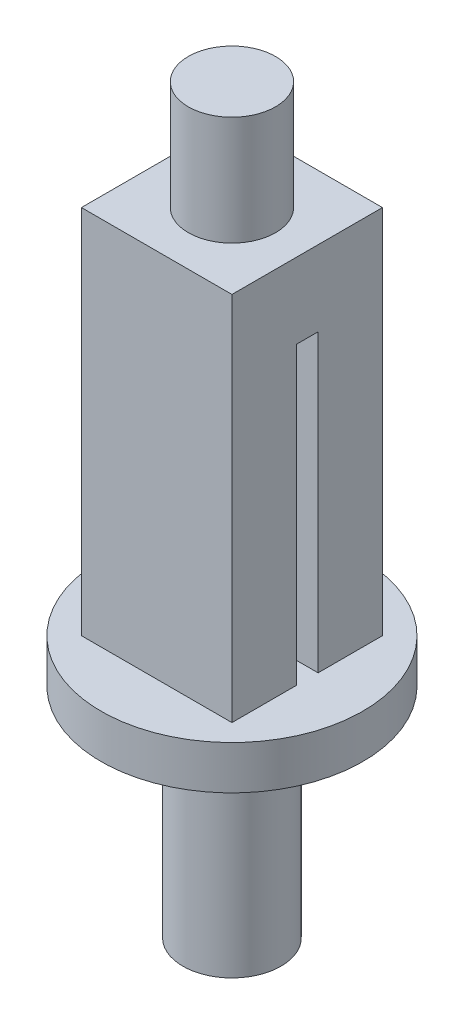
ISO-10303-21;
HEADER;
FILE_DESCRIPTION(('STEP AP214'),'2;1');
FILE_NAME('part.step','',(''),(''),'','','');
FILE_SCHEMA(('AUTOMOTIVE_DESIGN { 1 0 10303 214 1 1 1 1 }'));
ENDSEC;
DATA;
#1=APPLICATION_CONTEXT('core data for automotive mechanical design processes');
#2=APPLICATION_PROTOCOL_DEFINITION('international standard','automotive_design',2000,#1);
#3=PRODUCT_CONTEXT('',#1,'mechanical');
#4=PRODUCT('Part','Part','',(#3));
#5=PRODUCT_RELATED_PRODUCT_CATEGORY('part','',(#4));
#6=PRODUCT_DEFINITION_FORMATION('','',#4);
#7=PRODUCT_DEFINITION_CONTEXT('part definition',#1,'design');
#8=PRODUCT_DEFINITION('design','',#6,#7);
#9=PRODUCT_DEFINITION_SHAPE('','',#8);
#10=(LENGTH_UNIT() NAMED_UNIT(*) SI_UNIT(.MILLI.,.METRE.));
#11=(NAMED_UNIT(*) PLANE_ANGLE_UNIT() SI_UNIT($,.RADIAN.));
#12=(NAMED_UNIT(*) SI_UNIT($,.STERADIAN.) SOLID_ANGLE_UNIT());
#13=UNCERTAINTY_MEASURE_WITH_UNIT(LENGTH_MEASURE(1.E-05),#10,'distance_accuracy_value','');
#14=(GEOMETRIC_REPRESENTATION_CONTEXT(3) GLOBAL_UNCERTAINTY_ASSIGNED_CONTEXT((#13)) GLOBAL_UNIT_ASSIGNED_CONTEXT((#10,
#11,#12)) REPRESENTATION_CONTEXT('',''));
#15=CARTESIAN_POINT('',(0.,0.,0.));
#16=DIRECTION('',(0.,0.,1.));
#17=DIRECTION('',(1.,0.,0.));
#18=AXIS2_PLACEMENT_3D('',#15,#16,#17);
#19=CARTESIAN_POINT('',(11.4316176470588,0.,-1.12573529411769));
#20=DIRECTION('',(0.,0.,-1.));
#21=DIRECTION('',(-1.,0.,0.));
#22=AXIS2_PLACEMENT_3D('',#19,#20,#21);
#23=PLANE('',#22);
#24=DIRECTION('',(-1.,0.,0.));
#25=VECTOR('',#24,1.);
#26=CARTESIAN_POINT('',(11.4316176470588,13.5425407491431,-1.12573529411769));
#27=LINE('',#26,#25);
#28=CARTESIAN_POINT('',(3.33161764705882,13.5425407491431,-1.12573529411769));
#29=VERTEX_POINT('',#28);
#30=CARTESIAN_POINT('',(1.29583120943192,13.5425407491431,-1.12573529411768));
#31=VERTEX_POINT('',#30);
#32=EDGE_CURVE('E175',#29,#31,#27,.T.);
#33=ORIENTED_EDGE('',*,*,#32,.T.);
#34=DIRECTION('',(0.,-1.,0.));
#35=VECTOR('',#34,1.);
#36=CARTESIAN_POINT('',(1.29583120943192,17.7851814362623,-1.12573529411769));
#37=LINE('',#36,#35);
#38=CARTESIAN_POINT('',(1.29583120943192,0.,-1.12573529411769));
#39=VERTEX_POINT('',#38);
#40=EDGE_CURVE('E270',#31,#39,#37,.T.);
#41=ORIENTED_EDGE('',*,*,#40,.T.);
#42=DIRECTION('',(-1.,0.,0.));
#43=VECTOR('',#42,1.);
#44=CARTESIAN_POINT('',(0.,0.,-1.12573529411768));
#45=LINE('',#44,#43);
#46=CARTESIAN_POINT('',(3.33161764705882,0.,-1.12573529411769));
#47=VERTEX_POINT('',#46);
#48=EDGE_CURVE('E234',#47,#39,#45,.T.);
#49=ORIENTED_EDGE('',*,*,#48,.F.);
#50=DIRECTION('',(0.,-1.,0.));
#51=VECTOR('',#50,1.);
#52=CARTESIAN_POINT('',(3.33161764705882,17.,-1.12573529411769));
#53=LINE('',#52,#51);
#54=EDGE_CURVE('E180',#29,#47,#53,.T.);
#55=ORIENTED_EDGE('',*,*,#54,.F.);
#56=EDGE_LOOP('',(#33,#41,#49,#55));
#57=FACE_BOUND('',#56,.T.);
#58=ADVANCED_FACE('F39',(#57),#23,.F.);
#59=CARTESIAN_POINT('',(11.4316176470588,0.,-0.125735294117686));
#60=DIRECTION('',(0.,0.,1.));
#61=DIRECTION('',(1.,0.,0.));
#62=AXIS2_PLACEMENT_3D('',#59,#60,#61);
#63=PLANE('',#62);
#64=DIRECTION('',(-1.,0.,0.));
#65=VECTOR('',#64,1.);
#66=CARTESIAN_POINT('',(11.4316176470588,13.5425407491431,-0.125735294117686));
#67=LINE('',#66,#65);
#68=CARTESIAN_POINT('',(-1.53259591531427,13.5425407491431,-0.125735294117684));
#69=VERTEX_POINT('',#68);
#70=CARTESIAN_POINT('',(-3.56838235294118,13.5425407491431,-0.125735294117684));
#71=VERTEX_POINT('',#70);
#72=EDGE_CURVE('E154',#69,#71,#67,.T.);
#73=ORIENTED_EDGE('',*,*,#72,.F.);
#74=DIRECTION('',(0.,-1.,0.));
#75=VECTOR('',#74,1.);
#76=CARTESIAN_POINT('',(-1.53259591531427,17.7851814362623,-0.125735294117685));
#77=LINE('',#76,#75);
#78=CARTESIAN_POINT('',(-1.53259591531427,0.,-0.125735294117685));
#79=VERTEX_POINT('',#78);
#80=EDGE_CURVE('E138',#69,#79,#77,.T.);
#81=ORIENTED_EDGE('',*,*,#80,.T.);
#82=DIRECTION('',(1.,0.,0.));
#83=VECTOR('',#82,1.);
#84=CARTESIAN_POINT('',(0.,0.,-0.125735294117685));
#85=LINE('',#84,#83);
#86=CARTESIAN_POINT('',(-3.56838235294118,0.,-0.125735294117684));
#87=VERTEX_POINT('',#86);
#88=EDGE_CURVE('E231',#87,#79,#85,.T.);
#89=ORIENTED_EDGE('',*,*,#88,.F.);
#90=DIRECTION('',(0.,1.,0.));
#91=VECTOR('',#90,1.);
#92=CARTESIAN_POINT('',(-3.56838235294118,0.,-0.125735294117684));
#93=LINE('',#92,#91);
#94=EDGE_CURVE('E164',#87,#71,#93,.T.);
#95=ORIENTED_EDGE('',*,*,#94,.T.);
#96=EDGE_LOOP('',(#73,#81,#89,#95));
#97=FACE_BOUND('',#96,.T.);
#98=ADVANCED_FACE('F162',(#97),#63,.F.);
#99=CARTESIAN_POINT('',(-3.56838235294118,17.,-4.07573529411765));
#100=DIRECTION('',(1.,0.,0.));
#101=DIRECTION('',(0.,0.,-1.));
#102=AXIS2_PLACEMENT_3D('',#99,#100,#101);
#103=PLANE('',#102);
#104=DIRECTION('',(0.,0.,1.));
#105=VECTOR('',#104,1.);
#106=CARTESIAN_POINT('',(-3.56838235294118,0.,-4.07573529411765));
#107=LINE('',#106,#105);
#108=CARTESIAN_POINT('',(-3.56838235294118,0.,-4.07573529411765));
#109=VERTEX_POINT('',#108);
#110=CARTESIAN_POINT('',(-3.56838235294118,0.,-1.12573529411768));
#111=VERTEX_POINT('',#110);
#112=EDGE_CURVE('E206',#109,#111,#107,.T.);
#113=ORIENTED_EDGE('',*,*,#112,.T.);
#114=DIRECTION('',(0.,-1.,0.));
#115=VECTOR('',#114,1.);
#116=CARTESIAN_POINT('',(-3.56838235294118,0.,-1.12573529411768));
#117=LINE('',#116,#115);
#118=CARTESIAN_POINT('',(-3.56838235294118,13.5425407491431,-1.12573529411768));
#119=VERTEX_POINT('',#118);
#120=EDGE_CURVE('E250',#119,#111,#117,.T.);
#121=ORIENTED_EDGE('',*,*,#120,.F.);
#122=DIRECTION('',(0.,0.,-1.));
#123=VECTOR('',#122,1.);
#124=CARTESIAN_POINT('',(-3.56838235294118,13.5425407491431,-1.12573529411768));
#125=LINE('',#124,#123);
#126=EDGE_CURVE('E167',#71,#119,#125,.T.);
#127=ORIENTED_EDGE('',*,*,#126,.F.);
#128=ORIENTED_EDGE('',*,*,#94,.F.);
#129=CARTESIAN_POINT('',(-3.56838235294118,0.,2.82426470588235));
#130=VERTEX_POINT('',#129);
#131=EDGE_CURVE('E188',#87,#130,#107,.T.);
#132=ORIENTED_EDGE('',*,*,#131,.T.);
#133=DIRECTION('',(0.,-1.,0.));
#134=VECTOR('',#133,1.);
#135=CARTESIAN_POINT('',(-3.56838235294118,17.,2.82426470588235));
#136=LINE('',#135,#134);
#137=CARTESIAN_POINT('',(-3.56838235294118,17.,2.82426470588235));
#138=VERTEX_POINT('',#137);
#139=EDGE_CURVE('E194',#138,#130,#136,.T.);
#140=ORIENTED_EDGE('',*,*,#139,.F.);
#141=DIRECTION('',(0.,0.,1.));
#142=VECTOR('',#141,1.);
#143=CARTESIAN_POINT('',(-3.56838235294118,17.,-4.07573529411765));
#144=LINE('',#143,#142);
#145=CARTESIAN_POINT('',(-3.56838235294118,17.,-4.07573529411765));
#146=VERTEX_POINT('',#145);
#147=EDGE_CURVE('E195',#146,#138,#144,.T.);
#148=ORIENTED_EDGE('',*,*,#147,.F.);
#149=DIRECTION('',(0.,-1.,0.));
#150=VECTOR('',#149,1.);
#151=CARTESIAN_POINT('',(-3.56838235294118,17.,-4.07573529411765));
#152=LINE('',#151,#150);
#153=EDGE_CURVE('E205',#146,#109,#152,.T.);
#154=ORIENTED_EDGE('',*,*,#153,.T.);
#155=EDGE_LOOP('',(#113,#121,#127,#128,#132,#140,#148,#154));
#156=FACE_BOUND('',#155,.T.);
#157=ADVANCED_FACE('F41',(#156),#103,.F.);
#158=CARTESIAN_POINT('',(-3.56838235294118,17.,2.82426470588235));
#159=DIRECTION('',(0.,0.,-1.));
#160=DIRECTION('',(-1.,0.,0.));
#161=AXIS2_PLACEMENT_3D('',#158,#159,#160);
#162=PLANE('',#161);
#163=DIRECTION('',(1.,0.,0.));
#164=VECTOR('',#163,1.);
#165=CARTESIAN_POINT('',(-3.56838235294118,0.,2.82426470588235));
#166=LINE('',#165,#164);
#167=CARTESIAN_POINT('',(3.33161764705882,0.,2.82426470588235));
#168=VERTEX_POINT('',#167);
#169=EDGE_CURVE('E210',#130,#168,#166,.T.);
#170=ORIENTED_EDGE('',*,*,#169,.T.);
#171=DIRECTION('',(0.,-1.,0.));
#172=VECTOR('',#171,1.);
#173=CARTESIAN_POINT('',(3.33161764705882,17.,2.82426470588235));
#174=LINE('',#173,#172);
#175=CARTESIAN_POINT('',(3.33161764705882,17.,2.82426470588235));
#176=VERTEX_POINT('',#175);
#177=EDGE_CURVE('E225',#176,#168,#174,.T.);
#178=ORIENTED_EDGE('',*,*,#177,.F.);
#179=DIRECTION('',(1.,0.,0.));
#180=VECTOR('',#179,1.);
#181=CARTESIAN_POINT('',(-3.56838235294118,17.,2.82426470588235));
#182=LINE('',#181,#180);
#183=EDGE_CURVE('E94',#138,#176,#182,.T.);
#184=ORIENTED_EDGE('',*,*,#183,.F.);
#185=ORIENTED_EDGE('',*,*,#139,.T.);
#186=EDGE_LOOP('',(#170,#178,#184,#185));
#187=FACE_BOUND('',#186,.T.);
#188=ADVANCED_FACE('F353',(#187),#162,.F.);
#189=CARTESIAN_POINT('',(3.33161764705882,17.,-4.07573529411765));
#190=DIRECTION('',(-1.,0.,0.));
#191=DIRECTION('',(0.,0.,1.));
#192=AXIS2_PLACEMENT_3D('',#189,#190,#191);
#193=PLANE('',#192);
#194=DIRECTION('',(0.,0.,-1.));
#195=VECTOR('',#194,1.);
#196=CARTESIAN_POINT('',(3.33161764705882,13.5425407491431,-4.07573529411765));
#197=LINE('',#196,#195);
#198=CARTESIAN_POINT('',(3.33161764705882,13.5425407491431,-0.125735294117685));
#199=VERTEX_POINT('',#198);
#200=EDGE_CURVE('E43',#199,#29,#197,.T.);
#201=ORIENTED_EDGE('',*,*,#200,.T.);
#202=ORIENTED_EDGE('',*,*,#54,.T.);
#203=DIRECTION('',(0.,0.,-1.));
#204=VECTOR('',#203,1.);
#205=CARTESIAN_POINT('',(3.33161764705882,0.,-4.07573529411765));
#206=LINE('',#205,#204);
#207=CARTESIAN_POINT('',(3.33161764705882,0.,-4.07573529411765));
#208=VERTEX_POINT('',#207);
#209=EDGE_CURVE('E213',#47,#208,#206,.T.);
#210=ORIENTED_EDGE('',*,*,#209,.T.);
#211=DIRECTION('',(0.,-1.,0.));
#212=VECTOR('',#211,1.);
#213=CARTESIAN_POINT('',(3.33161764705882,17.,-4.07573529411765));
#214=LINE('',#213,#212);
#215=CARTESIAN_POINT('',(3.33161764705882,17.,-4.07573529411765));
#216=VERTEX_POINT('',#215);
#217=EDGE_CURVE('E222',#216,#208,#214,.T.);
#218=ORIENTED_EDGE('',*,*,#217,.F.);
#219=DIRECTION('',(0.,0.,-1.));
#220=VECTOR('',#219,1.);
#221=CARTESIAN_POINT('',(3.33161764705882,17.,-4.07573529411765));
#222=LINE('',#221,#220);
#223=EDGE_CURVE('E200',#176,#216,#222,.T.);
#224=ORIENTED_EDGE('',*,*,#223,.F.);
#225=ORIENTED_EDGE('',*,*,#177,.T.);
#226=CARTESIAN_POINT('',(3.33161764705882,0.,-0.125735294117685));
#227=VERTEX_POINT('',#226);
#228=EDGE_CURVE('E214',#168,#227,#206,.T.);
#229=ORIENTED_EDGE('',*,*,#228,.T.);
#230=DIRECTION('',(0.,1.,0.));
#231=VECTOR('',#230,1.);
#232=CARTESIAN_POINT('',(3.33161764705882,17.,-0.125735294117685));
#233=LINE('',#232,#231);
#234=EDGE_CURVE('E176',#227,#199,#233,.T.);
#235=ORIENTED_EDGE('',*,*,#234,.T.);
#236=EDGE_LOOP('',(#201,#202,#210,#218,#224,#225,#229,#235));
#237=FACE_BOUND('',#236,.T.);
#238=ADVANCED_FACE('F351',(#237),#193,.F.);
#239=CARTESIAN_POINT('',(-3.56838235294118,17.,-4.07573529411765));
#240=DIRECTION('',(0.,0.,1.));
#241=DIRECTION('',(1.,0.,0.));
#242=AXIS2_PLACEMENT_3D('',#239,#240,#241);
#243=PLANE('',#242);
#244=DIRECTION('',(-1.,0.,0.));
#245=VECTOR('',#244,1.);
#246=CARTESIAN_POINT('',(-3.56838235294118,0.,-4.07573529411765));
#247=LINE('',#246,#245);
#248=EDGE_CURVE('E86',#208,#109,#247,.T.);
#249=ORIENTED_EDGE('',*,*,#248,.T.);
#250=ORIENTED_EDGE('',*,*,#153,.F.);
#251=DIRECTION('',(-1.,0.,0.));
#252=VECTOR('',#251,1.);
#253=CARTESIAN_POINT('',(-3.56838235294118,17.,-4.07573529411765));
#254=LINE('',#253,#252);
#255=EDGE_CURVE('E65',#216,#146,#254,.T.);
#256=ORIENTED_EDGE('',*,*,#255,.F.);
#257=ORIENTED_EDGE('',*,*,#217,.T.);
#258=EDGE_LOOP('',(#249,#250,#256,#257));
#259=FACE_BOUND('',#258,.T.);
#260=ADVANCED_FACE('F347',(#259),#243,.F.);
#261=CARTESIAN_POINT('',(0.,17.,0.));
#262=DIRECTION('',(0.,1.,0.));
#263=DIRECTION('',(0.,0.,1.));
#264=AXIS2_PLACEMENT_3D('',#261,#262,#263);
#265=PLANE('',#264);
#266=CARTESIAN_POINT('',(-0.11838235294118,17.,-0.625735294117647));
#267=DIRECTION('',(0.,1.,0.));
#268=DIRECTION('',(0.,0.,1.));
#269=AXIS2_PLACEMENT_3D('',#266,#267,#268);
#270=CIRCLE('',#269,2.);
#271=CARTESIAN_POINT('',(-0.11838235294118,17.,1.37426470588235));
#272=VERTEX_POINT('',#271);
#273=EDGE_CURVE('E189',#272,#272,#270,.T.);
#274=ORIENTED_EDGE('',*,*,#273,.F.);
#275=EDGE_LOOP('',(#274));
#276=FACE_BOUND('',#275,.T.);
#277=ORIENTED_EDGE('',*,*,#147,.T.);
#278=ORIENTED_EDGE('',*,*,#183,.T.);
#279=ORIENTED_EDGE('',*,*,#223,.T.);
#280=ORIENTED_EDGE('',*,*,#255,.T.);
#281=EDGE_LOOP('',(#277,#278,#279,#280));
#282=FACE_BOUND('',#281,.T.);
#283=ADVANCED_FACE('F341',(#276,#282),#265,.T.);
#284=CARTESIAN_POINT('',(-0.11838235294118,22.,-0.625735294117647));
#285=DIRECTION('',(0.,-1.,0.));
#286=DIRECTION('',(0.,0.,-1.));
#287=AXIS2_PLACEMENT_3D('',#284,#285,#286);
#288=CYLINDRICAL_SURFACE('',#287,2.);
#289=CARTESIAN_POINT('',(-0.11838235294118,22.,-0.625735294117647));
#290=DIRECTION('',(0.,1.,0.));
#291=DIRECTION('',(0.,0.,1.));
#292=AXIS2_PLACEMENT_3D('',#289,#290,#291);
#293=CIRCLE('',#292,2.);
#294=CARTESIAN_POINT('',(-0.11838235294118,22.,1.37426470588235));
#295=VERTEX_POINT('',#294);
#296=EDGE_CURVE('E184',#295,#295,#293,.T.);
#297=ORIENTED_EDGE('',*,*,#296,.F.);
#298=EDGE_LOOP('',(#297));
#299=FACE_BOUND('',#298,.T.);
#300=ORIENTED_EDGE('',*,*,#273,.T.);
#301=EDGE_LOOP('',(#300));
#302=FACE_BOUND('',#301,.T.);
#303=ADVANCED_FACE('F336',(#299,#302),#288,.T.);
#304=CARTESIAN_POINT('',(-0.11838235294118,22.,-0.625735294117647));
#305=DIRECTION('',(0.,1.,0.));
#306=DIRECTION('',(0.,0.,1.));
#307=AXIS2_PLACEMENT_3D('',#304,#305,#306);
#308=PLANE('',#307);
#309=ORIENTED_EDGE('',*,*,#296,.T.);
#310=EDGE_LOOP('',(#309));
#311=FACE_BOUND('',#310,.T.);
#312=ADVANCED_FACE('F331',(#311),#308,.T.);
#313=CARTESIAN_POINT('',(11.4316176470588,13.5425407491431,-1.12573529411769));
#314=DIRECTION('',(0.,1.,0.));
#315=DIRECTION('',(0.,0.,1.));
#316=AXIS2_PLACEMENT_3D('',#313,#314,#315);
#317=PLANE('',#316);
#318=CARTESIAN_POINT('',(-1.53259591531427,13.5425407491431,-1.12573529411768));
#319=VERTEX_POINT('',#318);
#320=EDGE_CURVE('E171',#319,#119,#27,.T.);
#321=ORIENTED_EDGE('',*,*,#320,.F.);
#322=CARTESIAN_POINT('',(-0.11838235294118,13.5425407491431,-0.625735294117684));
#323=DIRECTION('',(0.,1.,0.));
#324=DIRECTION('',(0.,0.,1.));
#325=AXIS2_PLACEMENT_3D('',#322,#323,#324);
#326=CIRCLE('',#325,1.5);
#327=EDGE_CURVE('E159',#319,#31,#326,.F.);
#328=ORIENTED_EDGE('',*,*,#327,.T.);
#329=ORIENTED_EDGE('',*,*,#32,.F.);
#330=ORIENTED_EDGE('',*,*,#200,.F.);
#331=CARTESIAN_POINT('',(1.29583120943192,13.5425407491431,-0.125735294117685));
#332=VERTEX_POINT('',#331);
#333=EDGE_CURVE('E157',#199,#332,#67,.T.);
#334=ORIENTED_EDGE('',*,*,#333,.T.);
#335=EDGE_CURVE('E141',#332,#69,#326,.F.);
#336=ORIENTED_EDGE('',*,*,#335,.T.);
#337=ORIENTED_EDGE('',*,*,#72,.T.);
#338=ORIENTED_EDGE('',*,*,#126,.T.);
#339=EDGE_LOOP('',(#321,#328,#329,#330,#334,#336,#337,#338));
#340=FACE_BOUND('',#339,.T.);
#341=ADVANCED_FACE('F152',(#340),#317,.F.);
#342=CARTESIAN_POINT('',(-1.53259591531427,0.,-1.12573529411768));
#343=VERTEX_POINT('',#342);
#344=EDGE_CURVE('E233',#343,#111,#45,.T.);
#345=ORIENTED_EDGE('',*,*,#344,.F.);
#346=DIRECTION('',(0.,-1.,0.));
#347=VECTOR('',#346,1.);
#348=CARTESIAN_POINT('',(-1.53259591531427,17.7851814362623,-1.12573529411768));
#349=LINE('',#348,#347);
#350=EDGE_CURVE('E56',#343,#319,#349,.F.);
#351=ORIENTED_EDGE('',*,*,#350,.T.);
#352=ORIENTED_EDGE('',*,*,#320,.T.);
#353=ORIENTED_EDGE('',*,*,#120,.T.);
#354=EDGE_LOOP('',(#345,#351,#352,#353));
#355=FACE_BOUND('',#354,.T.);
#356=ADVANCED_FACE('F252',(#355),#23,.F.);
#357=CARTESIAN_POINT('',(1.29583120943192,0.,-0.125735294117685));
#358=VERTEX_POINT('',#357);
#359=EDGE_CURVE('E193',#358,#227,#85,.T.);
#360=ORIENTED_EDGE('',*,*,#359,.F.);
#361=DIRECTION('',(0.,-1.,0.));
#362=VECTOR('',#361,1.);
#363=CARTESIAN_POINT('',(1.29583120943192,17.7851814362623,-0.125735294117685));
#364=LINE('',#363,#362);
#365=EDGE_CURVE('E274',#358,#332,#364,.F.);
#366=ORIENTED_EDGE('',*,*,#365,.T.);
#367=ORIENTED_EDGE('',*,*,#333,.F.);
#368=ORIENTED_EDGE('',*,*,#234,.F.);
#369=EDGE_LOOP('',(#360,#366,#367,#368));
#370=FACE_BOUND('',#369,.T.);
#371=ADVANCED_FACE('F312',(#370),#63,.F.);
#372=CARTESIAN_POINT('',(-0.11838235294118,0.,-0.625735294117684));
#373=DIRECTION('',(0.,-1.,0.));
#374=DIRECTION('',(0.,0.,-1.));
#375=AXIS2_PLACEMENT_3D('',#372,#373,#374);
#376=PLANE('',#375);
#377=CARTESIAN_POINT('',(-0.11838235294118,0.,-0.625735294117684));
#378=DIRECTION('',(0.,-1.,0.));
#379=DIRECTION('',(0.,0.,-1.));
#380=AXIS2_PLACEMENT_3D('',#377,#378,#379);
#381=CIRCLE('',#380,6.);
#382=CARTESIAN_POINT('',(-0.11838235294118,0.,-6.62573529411769));
#383=VERTEX_POINT('',#382);
#384=EDGE_CURVE('E260',#383,#383,#381,.T.);
#385=ORIENTED_EDGE('',*,*,#384,.F.);
#386=EDGE_LOOP('',(#385));
#387=FACE_BOUND('',#386,.T.);
#388=ORIENTED_EDGE('',*,*,#48,.T.);
#389=CARTESIAN_POINT('',(-0.11838235294118,0.,-0.625735294117684));
#390=DIRECTION('',(0.,-1.,0.));
#391=DIRECTION('',(0.,0.,-1.));
#392=AXIS2_PLACEMENT_3D('',#389,#390,#391);
#393=CIRCLE('',#392,1.5);
#394=EDGE_CURVE('E277',#39,#358,#393,.T.);
#395=ORIENTED_EDGE('',*,*,#394,.T.);
#396=ORIENTED_EDGE('',*,*,#359,.T.);
#397=ORIENTED_EDGE('',*,*,#228,.F.);
#398=ORIENTED_EDGE('',*,*,#169,.F.);
#399=ORIENTED_EDGE('',*,*,#131,.F.);
#400=ORIENTED_EDGE('',*,*,#88,.T.);
#401=EDGE_CURVE('E143',#79,#343,#393,.T.);
#402=ORIENTED_EDGE('',*,*,#401,.T.);
#403=ORIENTED_EDGE('',*,*,#344,.T.);
#404=ORIENTED_EDGE('',*,*,#112,.F.);
#405=ORIENTED_EDGE('',*,*,#248,.F.);
#406=ORIENTED_EDGE('',*,*,#209,.F.);
#407=EDGE_LOOP('',(#388,#395,#396,#397,#398,#399,#400,#402,#403,#404,#405,#406));
#408=FACE_BOUND('',#407,.T.);
#409=ADVANCED_FACE('F245',(#387,#408),#376,.F.);
#410=CARTESIAN_POINT('',(-0.11838235294118,-2.,-0.625735294117684));
#411=DIRECTION('',(0.,1.,0.));
#412=DIRECTION('',(0.,0.,1.));
#413=AXIS2_PLACEMENT_3D('',#410,#411,#412);
#414=CYLINDRICAL_SURFACE('',#413,6.);
#415=CARTESIAN_POINT('',(-0.11838235294118,-2.,-0.625735294117684));
#416=DIRECTION('',(0.,-1.,0.));
#417=DIRECTION('',(0.,0.,-1.));
#418=AXIS2_PLACEMENT_3D('',#415,#416,#417);
#419=CIRCLE('',#418,6.);
#420=CARTESIAN_POINT('',(-0.11838235294118,-2.,-6.62573529411769));
#421=VERTEX_POINT('',#420);
#422=EDGE_CURVE('E254',#421,#421,#419,.T.);
#423=ORIENTED_EDGE('',*,*,#422,.F.);
#424=EDGE_LOOP('',(#423));
#425=FACE_BOUND('',#424,.T.);
#426=ORIENTED_EDGE('',*,*,#384,.T.);
#427=EDGE_LOOP('',(#426));
#428=FACE_BOUND('',#427,.T.);
#429=ADVANCED_FACE('F302',(#425,#428),#414,.T.);
#430=CARTESIAN_POINT('',(-0.11838235294118,-2.,-0.625735294117684));
#431=DIRECTION('',(0.,-1.,0.));
#432=DIRECTION('',(0.,0.,-1.));
#433=AXIS2_PLACEMENT_3D('',#430,#431,#432);
#434=PLANE('',#433);
#435=CARTESIAN_POINT('',(-0.11838235294118,-2.,-0.625735294117684));
#436=DIRECTION('',(0.,-1.,0.));
#437=DIRECTION('',(0.,0.,-1.));
#438=AXIS2_PLACEMENT_3D('',#435,#436,#437);
#439=CIRCLE('',#438,2.25);
#440=CARTESIAN_POINT('',(-0.11838235294118,-2.,-2.87573529411768));
#441=VERTEX_POINT('',#440);
#442=EDGE_CURVE('E11',#441,#441,#439,.T.);
#443=ORIENTED_EDGE('',*,*,#442,.F.);
#444=EDGE_LOOP('',(#443));
#445=FACE_BOUND('',#444,.T.);
#446=ORIENTED_EDGE('',*,*,#422,.T.);
#447=EDGE_LOOP('',(#446));
#448=FACE_BOUND('',#447,.T.);
#449=ADVANCED_FACE('F296',(#445,#448),#434,.T.);
#450=CARTESIAN_POINT('',(-0.11838235294118,-12.,-0.625735294117684));
#451=DIRECTION('',(0.,1.,0.));
#452=DIRECTION('',(0.,0.,1.));
#453=AXIS2_PLACEMENT_3D('',#450,#451,#452);
#454=CYLINDRICAL_SURFACE('',#453,2.25);
#455=CARTESIAN_POINT('',(-0.11838235294118,-12.,-0.625735294117684));
#456=DIRECTION('',(0.,-1.,0.));
#457=DIRECTION('',(0.,0.,-1.));
#458=AXIS2_PLACEMENT_3D('',#455,#456,#457);
#459=CIRCLE('',#458,2.25);
#460=CARTESIAN_POINT('',(-0.11838235294118,-12.,-2.87573529411768));
#461=VERTEX_POINT('',#460);
#462=EDGE_CURVE('E265',#461,#461,#459,.T.);
#463=ORIENTED_EDGE('',*,*,#462,.F.);
#464=EDGE_LOOP('',(#463));
#465=FACE_BOUND('',#464,.T.);
#466=ORIENTED_EDGE('',*,*,#442,.T.);
#467=EDGE_LOOP('',(#466));
#468=FACE_BOUND('',#467,.T.);
#469=ADVANCED_FACE('F290',(#465,#468),#454,.T.);
#470=CARTESIAN_POINT('',(-0.11838235294118,-12.,-0.625735294117684));
#471=DIRECTION('',(0.,-1.,0.));
#472=DIRECTION('',(0.,0.,-1.));
#473=AXIS2_PLACEMENT_3D('',#470,#471,#472);
#474=PLANE('',#473);
#475=CARTESIAN_POINT('',(-0.11838235294118,-12.,-0.625735294117684));
#476=DIRECTION('',(0.,-1.,0.));
#477=DIRECTION('',(0.,0.,-1.));
#478=AXIS2_PLACEMENT_3D('',#475,#476,#477);
#479=CIRCLE('',#478,1.5);
#480=CARTESIAN_POINT('',(-0.11838235294118,-12.,-2.12573529411768));
#481=VERTEX_POINT('',#480);
#482=EDGE_CURVE('E160',#481,#481,#479,.T.);
#483=ORIENTED_EDGE('',*,*,#482,.F.);
#484=EDGE_LOOP('',(#483));
#485=FACE_BOUND('',#484,.T.);
#486=ORIENTED_EDGE('',*,*,#462,.T.);
#487=EDGE_LOOP('',(#486));
#488=FACE_BOUND('',#487,.T.);
#489=ADVANCED_FACE('F287',(#485,#488),#474,.T.);
#490=CARTESIAN_POINT('',(-0.11838235294118,17.7851814362623,-0.625735294117684));
#491=DIRECTION('',(0.,-1.,0.));
#492=DIRECTION('',(0.,0.,-1.));
#493=AXIS2_PLACEMENT_3D('',#490,#491,#492);
#494=CYLINDRICAL_SURFACE('',#493,1.5);
#495=ORIENTED_EDGE('',*,*,#482,.T.);
#496=EDGE_LOOP('',(#495));
#497=FACE_BOUND('',#496,.T.);
#498=ORIENTED_EDGE('',*,*,#327,.F.);
#499=ORIENTED_EDGE('',*,*,#350,.F.);
#500=ORIENTED_EDGE('',*,*,#401,.F.);
#501=ORIENTED_EDGE('',*,*,#80,.F.);
#502=ORIENTED_EDGE('',*,*,#335,.F.);
#503=ORIENTED_EDGE('',*,*,#365,.F.);
#504=ORIENTED_EDGE('',*,*,#394,.F.);
#505=ORIENTED_EDGE('',*,*,#40,.F.);
#506=EDGE_LOOP('',(#498,#499,#500,#501,#502,#503,#504,#505));
#507=FACE_BOUND('',#506,.T.);
#508=ADVANCED_FACE('F140',(#497,#507),#494,.F.);
#509=CLOSED_SHELL('',(#58,#98,#157,#188,#238,#260,#283,#303,#312,#341,#356,#371,#409,#429,#449,
#469,#489,#508));
#510=MANIFOLD_SOLID_BREP('B2',#509);
#511=ADVANCED_BREP_SHAPE_REPRESENTATION('',(#18,#510),#14);
#512=SHAPE_DEFINITION_REPRESENTATION(#9,#511);
ENDSEC;
END-ISO-10303-21;
